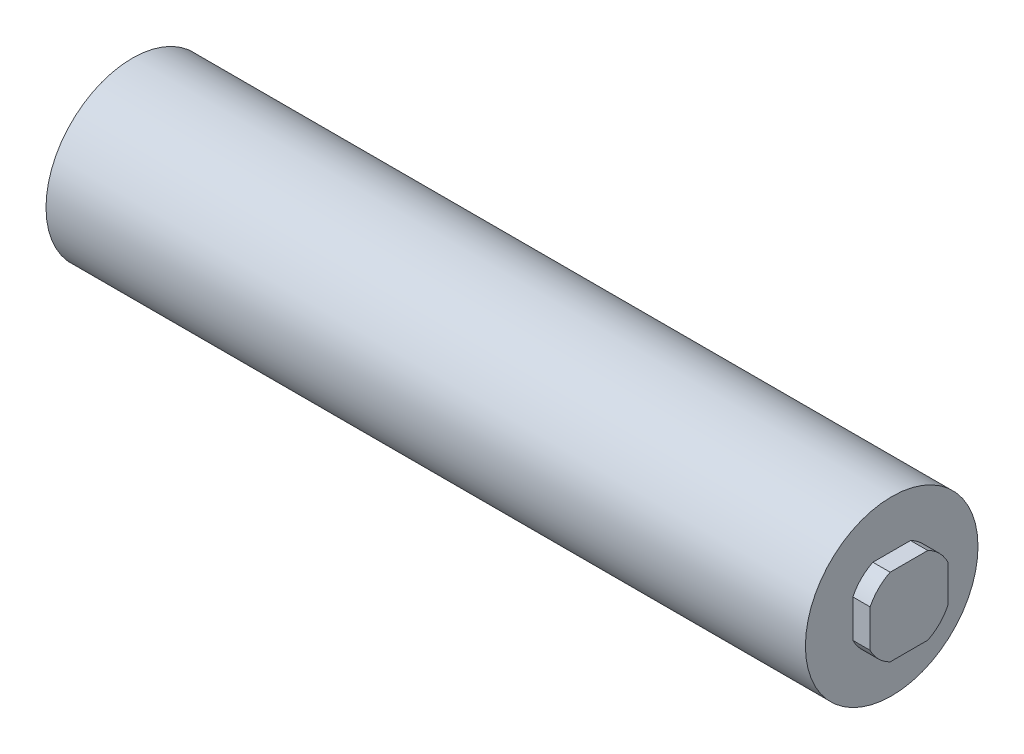
ISO-10303-21;
HEADER;
FILE_DESCRIPTION(('STEP AP214'),'2;1');
FILE_NAME('part.step','',(''),(''),'','','');
FILE_SCHEMA(('AUTOMOTIVE_DESIGN { 1 0 10303 214 1 1 1 1 }'));
ENDSEC;
DATA;
#1=APPLICATION_CONTEXT('core data for automotive mechanical design processes');
#2=APPLICATION_PROTOCOL_DEFINITION('international standard','automotive_design',2000,#1);
#3=PRODUCT_CONTEXT('',#1,'mechanical');
#4=PRODUCT('Part','Part','',(#3));
#5=PRODUCT_RELATED_PRODUCT_CATEGORY('part','',(#4));
#6=PRODUCT_DEFINITION_FORMATION('','',#4);
#7=PRODUCT_DEFINITION_CONTEXT('part definition',#1,'design');
#8=PRODUCT_DEFINITION('design','',#6,#7);
#9=PRODUCT_DEFINITION_SHAPE('','',#8);
#10=(LENGTH_UNIT() NAMED_UNIT(*) SI_UNIT(.MILLI.,.METRE.));
#11=(NAMED_UNIT(*) PLANE_ANGLE_UNIT() SI_UNIT($,.RADIAN.));
#12=(NAMED_UNIT(*) SI_UNIT($,.STERADIAN.) SOLID_ANGLE_UNIT());
#13=UNCERTAINTY_MEASURE_WITH_UNIT(LENGTH_MEASURE(1.E-05),#10,'distance_accuracy_value','');
#14=(GEOMETRIC_REPRESENTATION_CONTEXT(3) GLOBAL_UNCERTAINTY_ASSIGNED_CONTEXT((#13)) GLOBAL_UNIT_ASSIGNED_CONTEXT((#10,
#11,#12)) REPRESENTATION_CONTEXT('',''));
#15=CARTESIAN_POINT('',(0.,0.,0.));
#16=DIRECTION('',(0.,0.,1.));
#17=DIRECTION('',(1.,0.,0.));
#18=AXIS2_PLACEMENT_3D('',#15,#16,#17);
#19=CARTESIAN_POINT('',(45.,0.,0.));
#20=DIRECTION('',(-1.,0.,0.));
#21=DIRECTION('',(0.,0.,1.));
#22=AXIS2_PLACEMENT_3D('',#19,#20,#21);
#23=CYLINDRICAL_SURFACE('',#22,2.5);
#24=DIRECTION('',(-1.,0.,0.));
#25=VECTOR('',#24,1.);
#26=CARTESIAN_POINT('',(45.,2.25,-1.08972473588517));
#27=LINE('',#26,#25);
#28=CARTESIAN_POINT('',(45.,2.25,-1.08972473588517));
#29=VERTEX_POINT('',#28);
#30=CARTESIAN_POINT('',(44.,2.25,-1.08972473588517));
#31=VERTEX_POINT('',#30);
#32=EDGE_CURVE('E161',#29,#31,#27,.T.);
#33=ORIENTED_EDGE('',*,*,#32,.F.);
#34=CARTESIAN_POINT('',(45.,0.,0.));
#35=DIRECTION('',(1.,0.,0.));
#36=DIRECTION('',(0.,0.,-1.));
#37=AXIS2_PLACEMENT_3D('',#34,#35,#36);
#38=CIRCLE('',#37,2.5);
#39=CARTESIAN_POINT('',(45.,1.08972473588517,-2.25));
#40=VERTEX_POINT('',#39);
#41=EDGE_CURVE('E119',#40,#29,#38,.T.);
#42=ORIENTED_EDGE('',*,*,#41,.F.);
#43=DIRECTION('',(-1.,0.,0.));
#44=VECTOR('',#43,1.);
#45=CARTESIAN_POINT('',(45.,1.08972473588517,-2.25));
#46=LINE('',#45,#44);
#47=CARTESIAN_POINT('',(44.,1.08972473588517,-2.25));
#48=VERTEX_POINT('',#47);
#49=EDGE_CURVE('E102',#48,#40,#46,.F.);
#50=ORIENTED_EDGE('',*,*,#49,.F.);
#51=CARTESIAN_POINT('',(44.,0.,0.));
#52=DIRECTION('',(1.,0.,0.));
#53=DIRECTION('',(0.,0.,-1.));
#54=AXIS2_PLACEMENT_3D('',#51,#52,#53);
#55=CIRCLE('',#54,2.5);
#56=EDGE_CURVE('E117',#48,#31,#55,.T.);
#57=ORIENTED_EDGE('',*,*,#56,.T.);
#58=EDGE_LOOP('',(#33,#42,#50,#57));
#59=FACE_BOUND('',#58,.T.);
#60=ADVANCED_FACE('F35',(#59),#23,.T.);
#61=DIRECTION('',(-1.,0.,0.));
#62=VECTOR('',#61,1.);
#63=CARTESIAN_POINT('',(45.,2.25,1.08972473588517));
#64=LINE('',#63,#62);
#65=CARTESIAN_POINT('',(44.,2.25,1.08972473588517));
#66=VERTEX_POINT('',#65);
#67=CARTESIAN_POINT('',(45.,2.25,1.08972473588517));
#68=VERTEX_POINT('',#67);
#69=EDGE_CURVE('E164',#66,#68,#64,.F.);
#70=ORIENTED_EDGE('',*,*,#69,.F.);
#71=CARTESIAN_POINT('',(44.,1.08972473588517,2.25));
#72=VERTEX_POINT('',#71);
#73=EDGE_CURVE('E127',#66,#72,#55,.T.);
#74=ORIENTED_EDGE('',*,*,#73,.T.);
#75=DIRECTION('',(-1.,0.,0.));
#76=VECTOR('',#75,1.);
#77=CARTESIAN_POINT('',(45.,1.08972473588517,2.25));
#78=LINE('',#77,#76);
#79=CARTESIAN_POINT('',(45.,1.08972473588517,2.25));
#80=VERTEX_POINT('',#79);
#81=EDGE_CURVE('E166',#80,#72,#78,.T.);
#82=ORIENTED_EDGE('',*,*,#81,.F.);
#83=EDGE_CURVE('E152',#68,#80,#38,.T.);
#84=ORIENTED_EDGE('',*,*,#83,.F.);
#85=EDGE_LOOP('',(#70,#74,#82,#84));
#86=FACE_BOUND('',#85,.T.);
#87=ADVANCED_FACE('F178',(#86),#23,.T.);
#88=DIRECTION('',(-1.,0.,0.));
#89=VECTOR('',#88,1.);
#90=CARTESIAN_POINT('',(45.,-1.08972473588517,2.25));
#91=LINE('',#90,#89);
#92=CARTESIAN_POINT('',(44.,-1.08972473588517,2.25));
#93=VERTEX_POINT('',#92);
#94=CARTESIAN_POINT('',(45.,-1.08972473588517,2.25));
#95=VERTEX_POINT('',#94);
#96=EDGE_CURVE('E58',#93,#95,#91,.F.);
#97=ORIENTED_EDGE('',*,*,#96,.F.);
#98=CARTESIAN_POINT('',(44.,-2.25,1.08972473588517));
#99=VERTEX_POINT('',#98);
#100=EDGE_CURVE('E133',#93,#99,#55,.T.);
#101=ORIENTED_EDGE('',*,*,#100,.T.);
#102=DIRECTION('',(-1.,0.,0.));
#103=VECTOR('',#102,1.);
#104=CARTESIAN_POINT('',(45.,-2.25,1.08972473588517));
#105=LINE('',#104,#103);
#106=CARTESIAN_POINT('',(45.,-2.25,1.08972473588517));
#107=VERTEX_POINT('',#106);
#108=EDGE_CURVE('E158',#107,#99,#105,.T.);
#109=ORIENTED_EDGE('',*,*,#108,.F.);
#110=EDGE_CURVE('E150',#95,#107,#38,.T.);
#111=ORIENTED_EDGE('',*,*,#110,.F.);
#112=EDGE_LOOP('',(#97,#101,#109,#111));
#113=FACE_BOUND('',#112,.T.);
#114=ADVANCED_FACE('F156',(#113),#23,.T.);
#115=DIRECTION('',(-1.,0.,0.));
#116=VECTOR('',#115,1.);
#117=CARTESIAN_POINT('',(45.,-2.25,-1.08972473588517));
#118=LINE('',#117,#116);
#119=CARTESIAN_POINT('',(44.,-2.25,-1.08972473588517));
#120=VERTEX_POINT('',#119);
#121=CARTESIAN_POINT('',(45.,-2.25,-1.08972473588517));
#122=VERTEX_POINT('',#121);
#123=EDGE_CURVE('E50',#120,#122,#118,.F.);
#124=ORIENTED_EDGE('',*,*,#123,.F.);
#125=CARTESIAN_POINT('',(44.,-1.08972473588517,-2.25));
#126=VERTEX_POINT('',#125);
#127=EDGE_CURVE('E129',#120,#126,#55,.T.);
#128=ORIENTED_EDGE('',*,*,#127,.T.);
#129=DIRECTION('',(-1.,0.,0.));
#130=VECTOR('',#129,1.);
#131=CARTESIAN_POINT('',(45.,-1.08972473588517,-2.25));
#132=LINE('',#131,#130);
#133=CARTESIAN_POINT('',(45.,-1.08972473588517,-2.25));
#134=VERTEX_POINT('',#133);
#135=EDGE_CURVE('E105',#134,#126,#132,.T.);
#136=ORIENTED_EDGE('',*,*,#135,.F.);
#137=EDGE_CURVE('E159',#122,#134,#38,.T.);
#138=ORIENTED_EDGE('',*,*,#137,.F.);
#139=EDGE_LOOP('',(#124,#128,#136,#138));
#140=FACE_BOUND('',#139,.T.);
#141=ADVANCED_FACE('F182',(#140),#23,.T.);
#142=CARTESIAN_POINT('',(45.,0.,0.));
#143=DIRECTION('',(1.,0.,0.));
#144=DIRECTION('',(0.,0.,-1.));
#145=AXIS2_PLACEMENT_3D('',#142,#143,#144);
#146=PLANE('',#145);
#147=ORIENTED_EDGE('',*,*,#41,.T.);
#148=DIRECTION('',(0.,0.,1.));
#149=VECTOR('',#148,1.);
#150=CARTESIAN_POINT('',(45.,2.25,0.));
#151=LINE('',#150,#149);
#152=EDGE_CURVE('E12',#29,#68,#151,.T.);
#153=ORIENTED_EDGE('',*,*,#152,.T.);
#154=ORIENTED_EDGE('',*,*,#83,.T.);
#155=DIRECTION('',(0.,-1.,0.));
#156=VECTOR('',#155,1.);
#157=CARTESIAN_POINT('',(45.,0.,2.25));
#158=LINE('',#157,#156);
#159=EDGE_CURVE('E43',#80,#95,#158,.T.);
#160=ORIENTED_EDGE('',*,*,#159,.T.);
#161=ORIENTED_EDGE('',*,*,#110,.T.);
#162=DIRECTION('',(0.,0.,-1.));
#163=VECTOR('',#162,1.);
#164=CARTESIAN_POINT('',(45.,-2.25,0.));
#165=LINE('',#164,#163);
#166=EDGE_CURVE('E130',#107,#122,#165,.T.);
#167=ORIENTED_EDGE('',*,*,#166,.T.);
#168=ORIENTED_EDGE('',*,*,#137,.T.);
#169=DIRECTION('',(0.,1.,0.));
#170=VECTOR('',#169,1.);
#171=CARTESIAN_POINT('',(45.,0.,-2.25));
#172=LINE('',#171,#170);
#173=EDGE_CURVE('E126',#134,#40,#172,.T.);
#174=ORIENTED_EDGE('',*,*,#173,.T.);
#175=EDGE_LOOP('',(#147,#153,#154,#160,#161,#167,#168,#174));
#176=FACE_BOUND('',#175,.T.);
#177=ADVANCED_FACE('F149',(#176),#146,.T.);
#178=CARTESIAN_POINT('',(44.,0.,0.));
#179=DIRECTION('',(-1.,0.,0.));
#180=DIRECTION('',(0.,0.,1.));
#181=AXIS2_PLACEMENT_3D('',#178,#179,#180);
#182=CYLINDRICAL_SURFACE('',#181,5.);
#183=CARTESIAN_POINT('',(44.,0.,0.));
#184=DIRECTION('',(1.,0.,0.));
#185=DIRECTION('',(0.,0.,-1.));
#186=AXIS2_PLACEMENT_3D('',#183,#184,#185);
#187=CIRCLE('',#186,5.);
#188=CARTESIAN_POINT('',(44.,0.,-5.));
#189=VERTEX_POINT('',#188);
#190=EDGE_CURVE('E136',#189,#189,#187,.T.);
#191=ORIENTED_EDGE('',*,*,#190,.F.);
#192=EDGE_LOOP('',(#191));
#193=FACE_BOUND('',#192,.T.);
#194=CARTESIAN_POINT('',(0.,0.,0.));
#195=DIRECTION('',(1.,0.,0.));
#196=DIRECTION('',(0.,0.,-1.));
#197=AXIS2_PLACEMENT_3D('',#194,#195,#196);
#198=CIRCLE('',#197,5.);
#199=CARTESIAN_POINT('',(0.,0.,-5.));
#200=VERTEX_POINT('',#199);
#201=EDGE_CURVE('E140',#200,#200,#198,.T.);
#202=ORIENTED_EDGE('',*,*,#201,.T.);
#203=EDGE_LOOP('',(#202));
#204=FACE_BOUND('',#203,.T.);
#205=ADVANCED_FACE('F37',(#193,#204),#182,.T.);
#206=CARTESIAN_POINT('',(44.,0.,0.));
#207=DIRECTION('',(1.,0.,0.));
#208=DIRECTION('',(0.,0.,-1.));
#209=AXIS2_PLACEMENT_3D('',#206,#207,#208);
#210=PLANE('',#209);
#211=DIRECTION('',(0.,0.,-1.));
#212=VECTOR('',#211,1.);
#213=CARTESIAN_POINT('',(44.,2.25,2.25));
#214=LINE('',#213,#212);
#215=EDGE_CURVE('E111',#66,#31,#214,.T.);
#216=ORIENTED_EDGE('',*,*,#215,.T.);
#217=ORIENTED_EDGE('',*,*,#56,.F.);
#218=DIRECTION('',(0.,-1.,0.));
#219=VECTOR('',#218,1.);
#220=CARTESIAN_POINT('',(44.,-2.25,-2.25));
#221=LINE('',#220,#219);
#222=EDGE_CURVE('E99',#48,#126,#221,.T.);
#223=ORIENTED_EDGE('',*,*,#222,.T.);
#224=ORIENTED_EDGE('',*,*,#127,.F.);
#225=DIRECTION('',(0.,0.,1.));
#226=VECTOR('',#225,1.);
#227=CARTESIAN_POINT('',(44.,-2.25,2.25));
#228=LINE('',#227,#226);
#229=EDGE_CURVE('E110',#120,#99,#228,.T.);
#230=ORIENTED_EDGE('',*,*,#229,.T.);
#231=ORIENTED_EDGE('',*,*,#100,.F.);
#232=DIRECTION('',(0.,1.,0.));
#233=VECTOR('',#232,1.);
#234=CARTESIAN_POINT('',(44.,-2.25,2.25));
#235=LINE('',#234,#233);
#236=EDGE_CURVE('E120',#93,#72,#235,.T.);
#237=ORIENTED_EDGE('',*,*,#236,.T.);
#238=ORIENTED_EDGE('',*,*,#73,.F.);
#239=EDGE_LOOP('',(#216,#217,#223,#224,#230,#231,#237,#238));
#240=FACE_BOUND('',#239,.T.);
#241=ORIENTED_EDGE('',*,*,#190,.T.);
#242=EDGE_LOOP('',(#241));
#243=FACE_BOUND('',#242,.T.);
#244=ADVANCED_FACE('F123',(#240,#243),#210,.T.);
#245=CARTESIAN_POINT('',(0.,0.,0.));
#246=DIRECTION('',(1.,0.,0.));
#247=DIRECTION('',(0.,0.,-1.));
#248=AXIS2_PLACEMENT_3D('',#245,#246,#247);
#249=PLANE('',#248);
#250=ORIENTED_EDGE('',*,*,#201,.F.);
#251=EDGE_LOOP('',(#250));
#252=FACE_BOUND('',#251,.T.);
#253=ADVANCED_FACE('F192',(#252),#249,.F.);
#254=CARTESIAN_POINT('',(27.4725592896106,-2.25,-2.25));
#255=DIRECTION('',(0.,0.,-1.));
#256=DIRECTION('',(-1.,0.,0.));
#257=AXIS2_PLACEMENT_3D('',#254,#255,#256);
#258=PLANE('',#257);
#259=ORIENTED_EDGE('',*,*,#135,.T.);
#260=ORIENTED_EDGE('',*,*,#222,.F.);
#261=ORIENTED_EDGE('',*,*,#49,.T.);
#262=ORIENTED_EDGE('',*,*,#173,.F.);
#263=EDGE_LOOP('',(#259,#260,#261,#262));
#264=FACE_BOUND('',#263,.T.);
#265=ADVANCED_FACE('F101',(#264),#258,.T.);
#266=CARTESIAN_POINT('',(27.4725592896106,-2.25,2.25));
#267=DIRECTION('',(0.,-1.,0.));
#268=DIRECTION('',(0.,0.,-1.));
#269=AXIS2_PLACEMENT_3D('',#266,#267,#268);
#270=PLANE('',#269);
#271=ORIENTED_EDGE('',*,*,#108,.T.);
#272=ORIENTED_EDGE('',*,*,#229,.F.);
#273=ORIENTED_EDGE('',*,*,#123,.T.);
#274=ORIENTED_EDGE('',*,*,#166,.F.);
#275=EDGE_LOOP('',(#271,#272,#273,#274));
#276=FACE_BOUND('',#275,.T.);
#277=ADVANCED_FACE('F183',(#276),#270,.T.);
#278=CARTESIAN_POINT('',(27.4725592896106,-2.25,2.25));
#279=DIRECTION('',(0.,0.,1.));
#280=DIRECTION('',(1.,0.,0.));
#281=AXIS2_PLACEMENT_3D('',#278,#279,#280);
#282=PLANE('',#281);
#283=ORIENTED_EDGE('',*,*,#81,.T.);
#284=ORIENTED_EDGE('',*,*,#236,.F.);
#285=ORIENTED_EDGE('',*,*,#96,.T.);
#286=ORIENTED_EDGE('',*,*,#159,.F.);
#287=EDGE_LOOP('',(#283,#284,#285,#286));
#288=FACE_BOUND('',#287,.T.);
#289=ADVANCED_FACE('F185',(#288),#282,.T.);
#290=CARTESIAN_POINT('',(27.4725592896106,2.25,2.25));
#291=DIRECTION('',(0.,1.,0.));
#292=DIRECTION('',(0.,0.,1.));
#293=AXIS2_PLACEMENT_3D('',#290,#291,#292);
#294=PLANE('',#293);
#295=ORIENTED_EDGE('',*,*,#32,.T.);
#296=ORIENTED_EDGE('',*,*,#215,.F.);
#297=ORIENTED_EDGE('',*,*,#69,.T.);
#298=ORIENTED_EDGE('',*,*,#152,.F.);
#299=EDGE_LOOP('',(#295,#296,#297,#298));
#300=FACE_BOUND('',#299,.T.);
#301=ADVANCED_FACE('F180',(#300),#294,.T.);
#302=CLOSED_SHELL('',(#60,#87,#114,#141,#177,#205,#244,#253,#265,#277,#289,#301));
#303=MANIFOLD_SOLID_BREP('B2',#302);
#304=ADVANCED_BREP_SHAPE_REPRESENTATION('',(#18,#303),#14);
#305=SHAPE_DEFINITION_REPRESENTATION(#9,#304);
ENDSEC;
END-ISO-10303-21;
